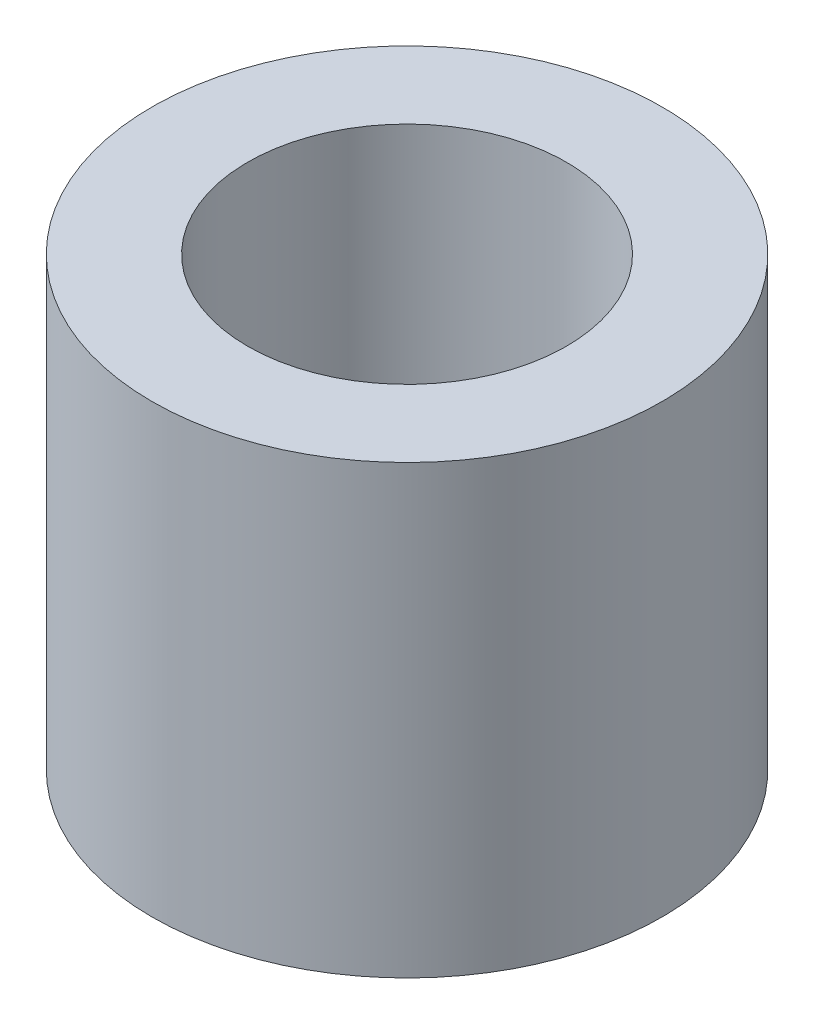
ISO-10303-21;
HEADER;
FILE_DESCRIPTION(('STEP AP214'),'2;1');
FILE_NAME('part.step','',(''),(''),'','','');
FILE_SCHEMA(('AUTOMOTIVE_DESIGN { 1 0 10303 214 1 1 1 1 }'));
ENDSEC;
DATA;
#1=APPLICATION_CONTEXT('core data for automotive mechanical design processes');
#2=APPLICATION_PROTOCOL_DEFINITION('international standard','automotive_design',2000,#1);
#3=PRODUCT_CONTEXT('',#1,'mechanical');
#4=PRODUCT('Part','Part','',(#3));
#5=PRODUCT_RELATED_PRODUCT_CATEGORY('part','',(#4));
#6=PRODUCT_DEFINITION_FORMATION('','',#4);
#7=PRODUCT_DEFINITION_CONTEXT('part definition',#1,'design');
#8=PRODUCT_DEFINITION('design','',#6,#7);
#9=PRODUCT_DEFINITION_SHAPE('','',#8);
#10=(LENGTH_UNIT() NAMED_UNIT(*) SI_UNIT(.MILLI.,.METRE.));
#11=(NAMED_UNIT(*) PLANE_ANGLE_UNIT() SI_UNIT($,.RADIAN.));
#12=(NAMED_UNIT(*) SI_UNIT($,.STERADIAN.) SOLID_ANGLE_UNIT());
#13=UNCERTAINTY_MEASURE_WITH_UNIT(LENGTH_MEASURE(1.E-05),#10,'distance_accuracy_value','');
#14=(GEOMETRIC_REPRESENTATION_CONTEXT(3) GLOBAL_UNCERTAINTY_ASSIGNED_CONTEXT((#13)) GLOBAL_UNIT_ASSIGNED_CONTEXT((#10,
#11,#12)) REPRESENTATION_CONTEXT('',''));
#15=CARTESIAN_POINT('',(0.,0.,0.));
#16=DIRECTION('',(0.,0.,1.));
#17=DIRECTION('',(1.,0.,0.));
#18=AXIS2_PLACEMENT_3D('',#15,#16,#17);
#19=CARTESIAN_POINT('',(0.,7.,0.));
#20=DIRECTION('',(0.,1.,0.));
#21=DIRECTION('',(0.,0.,1.));
#22=AXIS2_PLACEMENT_3D('',#19,#20,#21);
#23=PLANE('',#22);
#24=CARTESIAN_POINT('',(0.,7.,0.));
#25=DIRECTION('',(0.,1.,0.));
#26=DIRECTION('',(0.,0.,1.));
#27=AXIS2_PLACEMENT_3D('',#24,#25,#26);
#28=CIRCLE('',#27,4.);
#29=CARTESIAN_POINT('',(0.,7.,4.));
#30=VERTEX_POINT('',#29);
#31=EDGE_CURVE('E10',#30,#30,#28,.T.);
#32=ORIENTED_EDGE('',*,*,#31,.T.);
#33=EDGE_LOOP('',(#32));
#34=FACE_BOUND('',#33,.T.);
#35=CARTESIAN_POINT('',(0.,7.,0.));
#36=DIRECTION('',(0.,1.,0.));
#37=DIRECTION('',(0.,0.,1.));
#38=AXIS2_PLACEMENT_3D('',#35,#36,#37);
#39=CIRCLE('',#38,2.5);
#40=CARTESIAN_POINT('',(0.,7.,2.5));
#41=VERTEX_POINT('',#40);
#42=EDGE_CURVE('E42',#41,#41,#39,.T.);
#43=ORIENTED_EDGE('',*,*,#42,.F.);
#44=EDGE_LOOP('',(#43));
#45=FACE_BOUND('',#44,.T.);
#46=ADVANCED_FACE('F31',(#34,#45),#23,.T.);
#47=CARTESIAN_POINT('',(0.,0.,0.));
#48=DIRECTION('',(0.,1.,0.));
#49=DIRECTION('',(0.,0.,1.));
#50=AXIS2_PLACEMENT_3D('',#47,#48,#49);
#51=PLANE('',#50);
#52=CARTESIAN_POINT('',(0.,0.,0.));
#53=DIRECTION('',(0.,1.,0.));
#54=DIRECTION('',(0.,0.,1.));
#55=AXIS2_PLACEMENT_3D('',#52,#53,#54);
#56=CIRCLE('',#55,4.);
#57=CARTESIAN_POINT('',(0.,0.,4.));
#58=VERTEX_POINT('',#57);
#59=EDGE_CURVE('E35',#58,#58,#56,.T.);
#60=ORIENTED_EDGE('',*,*,#59,.F.);
#61=EDGE_LOOP('',(#60));
#62=FACE_BOUND('',#61,.T.);
#63=CARTESIAN_POINT('',(0.,0.,0.));
#64=DIRECTION('',(0.,1.,0.));
#65=DIRECTION('',(0.,0.,1.));
#66=AXIS2_PLACEMENT_3D('',#63,#64,#65);
#67=CIRCLE('',#66,2.5);
#68=CARTESIAN_POINT('',(0.,0.,2.5));
#69=VERTEX_POINT('',#68);
#70=EDGE_CURVE('E44',#69,#69,#67,.T.);
#71=ORIENTED_EDGE('',*,*,#70,.T.);
#72=EDGE_LOOP('',(#71));
#73=FACE_BOUND('',#72,.T.);
#74=ADVANCED_FACE('F54',(#62,#73),#51,.F.);
#75=CARTESIAN_POINT('',(0.,7.,0.));
#76=DIRECTION('',(0.,-1.,0.));
#77=DIRECTION('',(0.,0.,-1.));
#78=AXIS2_PLACEMENT_3D('',#75,#76,#77);
#79=CYLINDRICAL_SURFACE('',#78,4.);
#80=ORIENTED_EDGE('',*,*,#31,.F.);
#81=EDGE_LOOP('',(#80));
#82=FACE_BOUND('',#81,.T.);
#83=ORIENTED_EDGE('',*,*,#59,.T.);
#84=EDGE_LOOP('',(#83));
#85=FACE_BOUND('',#84,.T.);
#86=ADVANCED_FACE('F33',(#82,#85),#79,.T.);
#87=CARTESIAN_POINT('',(0.,7.,0.));
#88=DIRECTION('',(0.,-1.,0.));
#89=DIRECTION('',(0.,0.,-1.));
#90=AXIS2_PLACEMENT_3D('',#87,#88,#89);
#91=CYLINDRICAL_SURFACE('',#90,2.5);
#92=ORIENTED_EDGE('',*,*,#42,.T.);
#93=EDGE_LOOP('',(#92));
#94=FACE_BOUND('',#93,.T.);
#95=ORIENTED_EDGE('',*,*,#70,.F.);
#96=EDGE_LOOP('',(#95));
#97=FACE_BOUND('',#96,.T.);
#98=ADVANCED_FACE('F50',(#94,#97),#91,.F.);
#99=CLOSED_SHELL('',(#46,#74,#86,#98));
#100=MANIFOLD_SOLID_BREP('B2',#99);
#101=ADVANCED_BREP_SHAPE_REPRESENTATION('',(#18,#100),#14);
#102=SHAPE_DEFINITION_REPRESENTATION(#9,#101);
ENDSEC;
END-ISO-10303-21;
